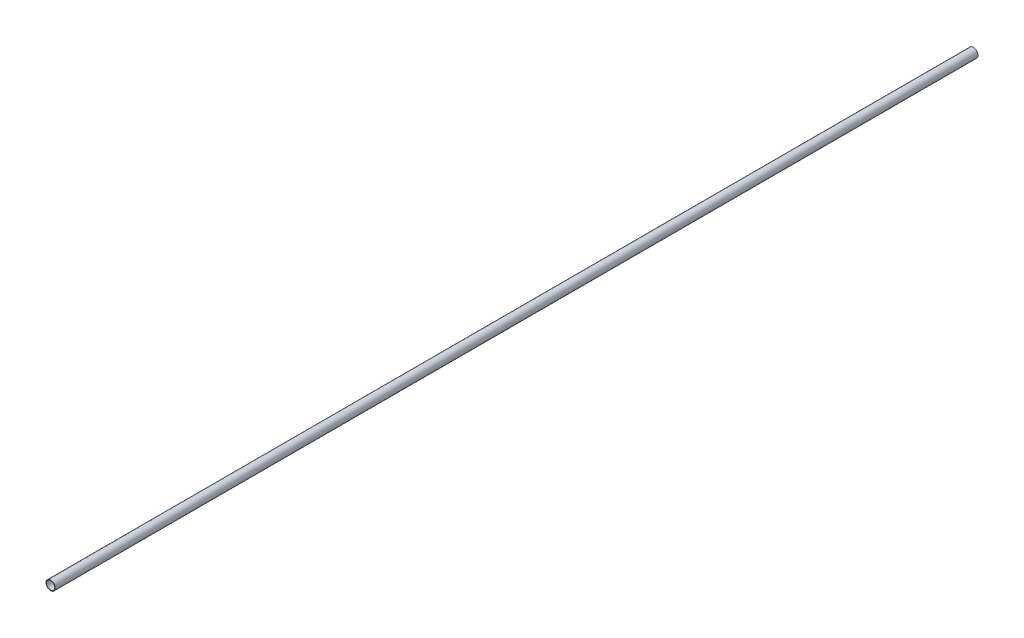
ISO-10303-21;
HEADER;
FILE_DESCRIPTION(('STEP AP214'),'2;1');
FILE_NAME('part.step','',(''),(''),'','','');
FILE_SCHEMA(('AUTOMOTIVE_DESIGN { 1 0 10303 214 1 1 1 1 }'));
ENDSEC;
DATA;
#1=APPLICATION_CONTEXT('core data for automotive mechanical design processes');
#2=APPLICATION_PROTOCOL_DEFINITION('international standard','automotive_design',2000,#1);
#3=PRODUCT_CONTEXT('',#1,'mechanical');
#4=PRODUCT('Part','Part','',(#3));
#5=PRODUCT_RELATED_PRODUCT_CATEGORY('part','',(#4));
#6=PRODUCT_DEFINITION_FORMATION('','',#4);
#7=PRODUCT_DEFINITION_CONTEXT('part definition',#1,'design');
#8=PRODUCT_DEFINITION('design','',#6,#7);
#9=PRODUCT_DEFINITION_SHAPE('','',#8);
#10=(LENGTH_UNIT() NAMED_UNIT(*) SI_UNIT(.MILLI.,.METRE.));
#11=(NAMED_UNIT(*) PLANE_ANGLE_UNIT() SI_UNIT($,.RADIAN.));
#12=(NAMED_UNIT(*) SI_UNIT($,.STERADIAN.) SOLID_ANGLE_UNIT());
#13=UNCERTAINTY_MEASURE_WITH_UNIT(LENGTH_MEASURE(1.E-05),#10,'distance_accuracy_value','');
#14=(GEOMETRIC_REPRESENTATION_CONTEXT(3) GLOBAL_UNCERTAINTY_ASSIGNED_CONTEXT((#13)) GLOBAL_UNIT_ASSIGNED_CONTEXT((#10,
#11,#12)) REPRESENTATION_CONTEXT('',''));
#15=CARTESIAN_POINT('',(0.,0.,0.));
#16=DIRECTION('',(0.,0.,1.));
#17=DIRECTION('',(1.,0.,0.));
#18=AXIS2_PLACEMENT_3D('',#15,#16,#17);
#19=CARTESIAN_POINT('',(0.,0.,1000.));
#20=DIRECTION('',(0.,0.,1.));
#21=DIRECTION('',(1.,0.,0.));
#22=AXIS2_PLACEMENT_3D('',#19,#20,#21);
#23=PLANE('',#22);
#24=CARTESIAN_POINT('',(0.,0.,1000.));
#25=DIRECTION('',(0.,0.,1.));
#26=DIRECTION('',(1.,0.,0.));
#27=AXIS2_PLACEMENT_3D('',#24,#25,#26);
#28=CIRCLE('',#27,10.);
#29=CARTESIAN_POINT('',(10.,0.,1000.));
#30=VERTEX_POINT('',#29);
#31=EDGE_CURVE('E10',#30,#30,#28,.T.);
#32=ORIENTED_EDGE('',*,*,#31,.T.);
#33=EDGE_LOOP('',(#32));
#34=FACE_BOUND('',#33,.T.);
#35=CARTESIAN_POINT('',(0.,0.,1000.));
#36=DIRECTION('',(0.,0.,1.));
#37=DIRECTION('',(1.,0.,0.));
#38=AXIS2_PLACEMENT_3D('',#35,#36,#37);
#39=CIRCLE('',#38,9.);
#40=CARTESIAN_POINT('',(9.,0.,1000.));
#41=VERTEX_POINT('',#40);
#42=EDGE_CURVE('E50',#41,#41,#39,.T.);
#43=ORIENTED_EDGE('',*,*,#42,.F.);
#44=EDGE_LOOP('',(#43));
#45=FACE_BOUND('',#44,.T.);
#46=ADVANCED_FACE('F37',(#34,#45),#23,.T.);
#47=CARTESIAN_POINT('',(0.,0.,-1000.));
#48=DIRECTION('',(0.,0.,1.));
#49=DIRECTION('',(1.,0.,0.));
#50=AXIS2_PLACEMENT_3D('',#47,#48,#49);
#51=PLANE('',#50);
#52=CARTESIAN_POINT('',(0.,0.,-1000.));
#53=DIRECTION('',(0.,0.,1.));
#54=DIRECTION('',(1.,0.,0.));
#55=AXIS2_PLACEMENT_3D('',#52,#53,#54);
#56=CIRCLE('',#55,10.);
#57=CARTESIAN_POINT('',(10.,0.,-1000.));
#58=VERTEX_POINT('',#57);
#59=EDGE_CURVE('E41',#58,#58,#56,.T.);
#60=ORIENTED_EDGE('',*,*,#59,.F.);
#61=EDGE_LOOP('',(#60));
#62=FACE_BOUND('',#61,.T.);
#63=CARTESIAN_POINT('',(0.,0.,-1000.));
#64=DIRECTION('',(0.,0.,1.));
#65=DIRECTION('',(1.,0.,0.));
#66=AXIS2_PLACEMENT_3D('',#63,#64,#65);
#67=CIRCLE('',#66,9.);
#68=CARTESIAN_POINT('',(9.,0.,-1000.));
#69=VERTEX_POINT('',#68);
#70=EDGE_CURVE('E52',#69,#69,#67,.T.);
#71=ORIENTED_EDGE('',*,*,#70,.T.);
#72=EDGE_LOOP('',(#71));
#73=FACE_BOUND('',#72,.T.);
#74=ADVANCED_FACE('F64',(#62,#73),#51,.F.);
#75=CARTESIAN_POINT('',(0.,0.,1000.));
#76=DIRECTION('',(0.,0.,-1.));
#77=DIRECTION('',(-1.,0.,0.));
#78=AXIS2_PLACEMENT_3D('',#75,#76,#77);
#79=CYLINDRICAL_SURFACE('',#78,10.);
#80=ORIENTED_EDGE('',*,*,#31,.F.);
#81=EDGE_LOOP('',(#80));
#82=FACE_BOUND('',#81,.T.);
#83=ORIENTED_EDGE('',*,*,#59,.T.);
#84=EDGE_LOOP('',(#83));
#85=FACE_BOUND('',#84,.T.);
#86=ADVANCED_FACE('F39',(#82,#85),#79,.T.);
#87=CARTESIAN_POINT('',(0.,0.,1000.));
#88=DIRECTION('',(0.,0.,-1.));
#89=DIRECTION('',(-1.,0.,0.));
#90=AXIS2_PLACEMENT_3D('',#87,#88,#89);
#91=CYLINDRICAL_SURFACE('',#90,9.);
#92=ORIENTED_EDGE('',*,*,#42,.T.);
#93=EDGE_LOOP('',(#92));
#94=FACE_BOUND('',#93,.T.);
#95=ORIENTED_EDGE('',*,*,#70,.F.);
#96=EDGE_LOOP('',(#95));
#97=FACE_BOUND('',#96,.T.);
#98=ADVANCED_FACE('F60',(#94,#97),#91,.F.);
#99=CLOSED_SHELL('',(#46,#74,#86,#98));
#100=MANIFOLD_SOLID_BREP('B2',#99);
#101=ADVANCED_BREP_SHAPE_REPRESENTATION('',(#18,#100),#14);
#102=SHAPE_DEFINITION_REPRESENTATION(#9,#101);
ENDSEC;
END-ISO-10303-21;
